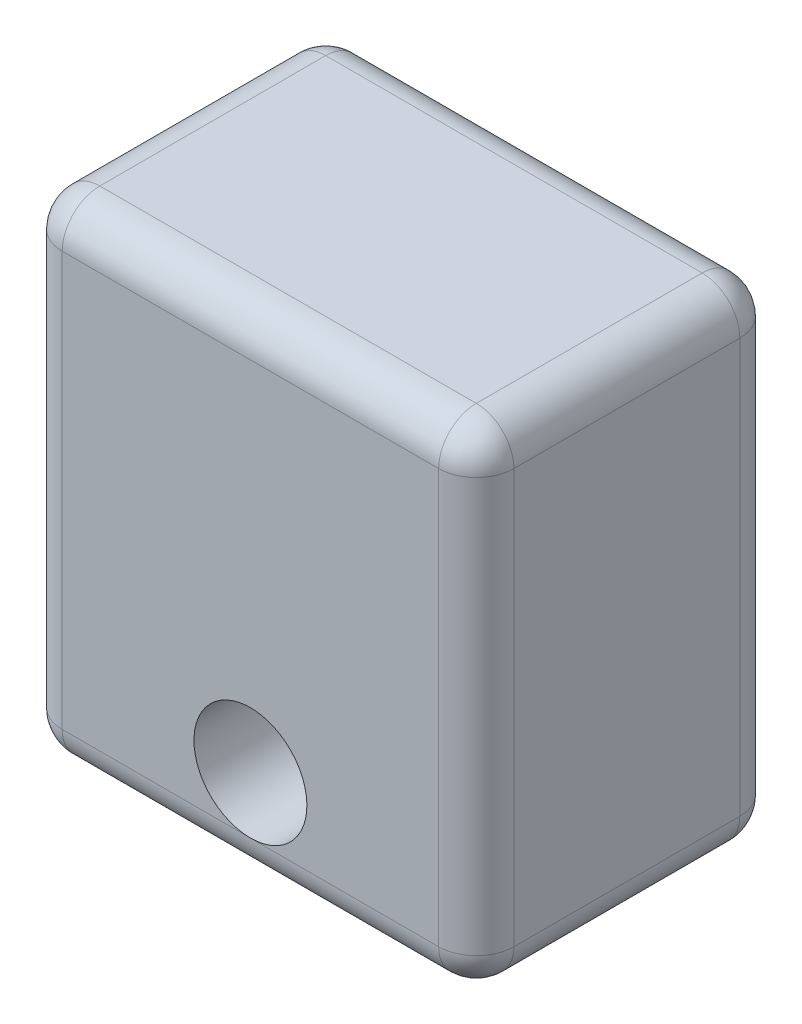
ISO-10303-21;
HEADER;
FILE_DESCRIPTION(('STEP AP214'),'2;1');
FILE_NAME('part.step','',(''),(''),'','','');
FILE_SCHEMA(('AUTOMOTIVE_DESIGN { 1 0 10303 214 1 1 1 1 }'));
ENDSEC;
DATA;
#1=APPLICATION_CONTEXT('core data for automotive mechanical design processes');
#2=APPLICATION_PROTOCOL_DEFINITION('international standard','automotive_design',2000,#1);
#3=PRODUCT_CONTEXT('',#1,'mechanical');
#4=PRODUCT('Part','Part','',(#3));
#5=PRODUCT_RELATED_PRODUCT_CATEGORY('part','',(#4));
#6=PRODUCT_DEFINITION_FORMATION('','',#4);
#7=PRODUCT_DEFINITION_CONTEXT('part definition',#1,'design');
#8=PRODUCT_DEFINITION('design','',#6,#7);
#9=PRODUCT_DEFINITION_SHAPE('','',#8);
#10=(LENGTH_UNIT() NAMED_UNIT(*) SI_UNIT(.MILLI.,.METRE.));
#11=(NAMED_UNIT(*) PLANE_ANGLE_UNIT() SI_UNIT($,.RADIAN.));
#12=(NAMED_UNIT(*) SI_UNIT($,.STERADIAN.) SOLID_ANGLE_UNIT());
#13=UNCERTAINTY_MEASURE_WITH_UNIT(LENGTH_MEASURE(1.E-05),#10,'distance_accuracy_value','');
#14=(GEOMETRIC_REPRESENTATION_CONTEXT(3) GLOBAL_UNCERTAINTY_ASSIGNED_CONTEXT((#13)) GLOBAL_UNIT_ASSIGNED_CONTEXT((#10,
#11,#12)) REPRESENTATION_CONTEXT('',''));
#15=CARTESIAN_POINT('',(0.,0.,0.));
#16=DIRECTION('',(0.,0.,1.));
#17=DIRECTION('',(1.,0.,0.));
#18=AXIS2_PLACEMENT_3D('',#15,#16,#17);
#19=CARTESIAN_POINT('',(0.,0.,25.4));
#20=DIRECTION('',(0.,0.,-1.));
#21=DIRECTION('',(-1.,0.,0.));
#22=AXIS2_PLACEMENT_3D('',#19,#20,#21);
#23=PLANE('',#22);
#24=DIRECTION('',(-1.,0.,0.));
#25=VECTOR('',#24,1.);
#26=CARTESIAN_POINT('',(0.,53.975,25.4));
#27=LINE('',#26,#25);
#28=CARTESIAN_POINT('',(31.75,53.975,25.4));
#29=VERTEX_POINT('',#28);
#30=CARTESIAN_POINT('',(-31.75,53.975,25.4));
#31=VERTEX_POINT('',#30);
#32=EDGE_CURVE('E204',#29,#31,#27,.T.);
#33=ORIENTED_EDGE('',*,*,#32,.T.);
#34=DIRECTION('',(0.,-1.,0.));
#35=VECTOR('',#34,1.);
#36=CARTESIAN_POINT('',(-31.75,0.,25.4));
#37=LINE('',#36,#35);
#38=CARTESIAN_POINT('',(-31.75,-15.875,25.4));
#39=VERTEX_POINT('',#38);
#40=EDGE_CURVE('E214',#31,#39,#37,.T.);
#41=ORIENTED_EDGE('',*,*,#40,.T.);
#42=DIRECTION('',(1.,0.,0.));
#43=VECTOR('',#42,1.);
#44=CARTESIAN_POINT('',(0.,-15.875,25.4));
#45=LINE('',#44,#43);
#46=CARTESIAN_POINT('',(0.,-15.875,25.4));
#47=VERTEX_POINT('',#46);
#48=EDGE_CURVE('E210',#39,#47,#45,.T.);
#49=ORIENTED_EDGE('',*,*,#48,.T.);
#50=CARTESIAN_POINT('',(0.,-6.35,25.4));
#51=DIRECTION('',(0.,0.,1.));
#52=DIRECTION('',(1.,0.,0.));
#53=AXIS2_PLACEMENT_3D('',#50,#51,#52);
#54=CIRCLE('',#53,9.525);
#55=EDGE_CURVE('E175',#47,#47,#54,.T.);
#56=ORIENTED_EDGE('',*,*,#55,.F.);
#57=DIRECTION('',(1.,0.,0.));
#58=VECTOR('',#57,1.);
#59=CARTESIAN_POINT('',(0.,-15.875,25.4));
#60=LINE('',#59,#58);
#61=CARTESIAN_POINT('',(31.75,-15.875,25.4));
#62=VERTEX_POINT('',#61);
#63=EDGE_CURVE('E207',#47,#62,#60,.T.);
#64=ORIENTED_EDGE('',*,*,#63,.T.);
#65=DIRECTION('',(0.,1.,0.));
#66=VECTOR('',#65,1.);
#67=CARTESIAN_POINT('',(31.75,0.,25.4));
#68=LINE('',#67,#66);
#69=EDGE_CURVE('E201',#62,#29,#68,.T.);
#70=ORIENTED_EDGE('',*,*,#69,.T.);
#71=EDGE_LOOP('',(#33,#41,#49,#56,#64,#70));
#72=FACE_BOUND('',#71,.T.);
#73=ADVANCED_FACE('F44',(#72),#23,.F.);
#74=CARTESIAN_POINT('',(0.,0.,-25.4));
#75=DIRECTION('',(0.,0.,-1.));
#76=DIRECTION('',(-1.,0.,0.));
#77=AXIS2_PLACEMENT_3D('',#74,#75,#76);
#78=PLANE('',#77);
#79=CARTESIAN_POINT('',(0.,-6.35,-25.4));
#80=DIRECTION('',(0.,0.,1.));
#81=DIRECTION('',(1.,0.,0.));
#82=AXIS2_PLACEMENT_3D('',#79,#80,#81);
#83=CIRCLE('',#82,9.525);
#84=CARTESIAN_POINT('',(0.,-15.875,-25.4));
#85=VERTEX_POINT('',#84);
#86=EDGE_CURVE('E346',#85,#85,#83,.T.);
#87=ORIENTED_EDGE('',*,*,#86,.T.);
#88=DIRECTION('',(1.,0.,0.));
#89=VECTOR('',#88,1.);
#90=CARTESIAN_POINT('',(-38.1,-15.875,-25.4));
#91=LINE('',#90,#89);
#92=CARTESIAN_POINT('',(-31.75,-15.875,-25.4));
#93=VERTEX_POINT('',#92);
#94=EDGE_CURVE('E243',#85,#93,#91,.F.);
#95=ORIENTED_EDGE('',*,*,#94,.T.);
#96=DIRECTION('',(0.,-1.,0.));
#97=VECTOR('',#96,1.);
#98=CARTESIAN_POINT('',(-31.75,60.325,-25.4));
#99=LINE('',#98,#97);
#100=CARTESIAN_POINT('',(-31.75,53.975,-25.4));
#101=VERTEX_POINT('',#100);
#102=EDGE_CURVE('E240',#93,#101,#99,.F.);
#103=ORIENTED_EDGE('',*,*,#102,.T.);
#104=DIRECTION('',(-1.,0.,0.));
#105=VECTOR('',#104,1.);
#106=CARTESIAN_POINT('',(38.1,53.975,-25.4));
#107=LINE('',#106,#105);
#108=CARTESIAN_POINT('',(31.75,53.975,-25.4));
#109=VERTEX_POINT('',#108);
#110=EDGE_CURVE('E233',#101,#109,#107,.F.);
#111=ORIENTED_EDGE('',*,*,#110,.T.);
#112=DIRECTION('',(0.,1.,0.));
#113=VECTOR('',#112,1.);
#114=CARTESIAN_POINT('',(31.75,-22.225,-25.4));
#115=LINE('',#114,#113);
#116=CARTESIAN_POINT('',(31.75,-15.875,-25.4));
#117=VERTEX_POINT('',#116);
#118=EDGE_CURVE('E230',#109,#117,#115,.F.);
#119=ORIENTED_EDGE('',*,*,#118,.T.);
#120=DIRECTION('',(1.,0.,0.));
#121=VECTOR('',#120,1.);
#122=CARTESIAN_POINT('',(-38.1,-15.875,-25.4));
#123=LINE('',#122,#121);
#124=EDGE_CURVE('E236',#117,#85,#123,.F.);
#125=ORIENTED_EDGE('',*,*,#124,.T.);
#126=EDGE_LOOP('',(#87,#95,#103,#111,#119,#125));
#127=FACE_BOUND('',#126,.T.);
#128=ADVANCED_FACE('F388',(#127),#78,.T.);
#129=CARTESIAN_POINT('',(38.1,-22.225,25.4));
#130=DIRECTION('',(-1.,0.,0.));
#131=DIRECTION('',(0.,-1.,0.));
#132=AXIS2_PLACEMENT_3D('',#129,#130,#131);
#133=PLANE('',#132);
#134=DIRECTION('',(0.,0.,-1.));
#135=VECTOR('',#134,1.);
#136=CARTESIAN_POINT('',(38.1,53.975,25.4));
#137=LINE('',#136,#135);
#138=CARTESIAN_POINT('',(38.1,53.975,-19.05));
#139=VERTEX_POINT('',#138);
#140=CARTESIAN_POINT('',(38.1,53.975,19.05));
#141=VERTEX_POINT('',#140);
#142=EDGE_CURVE('E220',#139,#141,#137,.F.);
#143=ORIENTED_EDGE('',*,*,#142,.T.);
#144=DIRECTION('',(0.,1.,0.));
#145=VECTOR('',#144,1.);
#146=CARTESIAN_POINT('',(38.1,-22.225,19.05));
#147=LINE('',#146,#145);
#148=CARTESIAN_POINT('',(38.1,-15.875,19.05));
#149=VERTEX_POINT('',#148);
#150=EDGE_CURVE('E227',#141,#149,#147,.F.);
#151=ORIENTED_EDGE('',*,*,#150,.T.);
#152=DIRECTION('',(0.,0.,-1.));
#153=VECTOR('',#152,1.);
#154=CARTESIAN_POINT('',(38.1,-15.875,25.4));
#155=LINE('',#154,#153);
#156=CARTESIAN_POINT('',(38.1,-15.875,-19.05));
#157=VERTEX_POINT('',#156);
#158=EDGE_CURVE('E223',#149,#157,#155,.T.);
#159=ORIENTED_EDGE('',*,*,#158,.T.);
#160=DIRECTION('',(0.,1.,0.));
#161=VECTOR('',#160,1.);
#162=CARTESIAN_POINT('',(38.1,60.325,-19.05));
#163=LINE('',#162,#161);
#164=EDGE_CURVE('E217',#157,#139,#163,.T.);
#165=ORIENTED_EDGE('',*,*,#164,.T.);
#166=EDGE_LOOP('',(#143,#151,#159,#165));
#167=FACE_BOUND('',#166,.T.);
#168=ADVANCED_FACE('F409',(#167),#133,.F.);
#169=CARTESIAN_POINT('',(-38.1,60.325,25.4));
#170=DIRECTION('',(0.,-1.,0.));
#171=DIRECTION('',(0.,0.,-1.));
#172=AXIS2_PLACEMENT_3D('',#169,#170,#171);
#173=PLANE('',#172);
#174=DIRECTION('',(-1.,0.,0.));
#175=VECTOR('',#174,1.);
#176=CARTESIAN_POINT('',(-38.1,60.325,19.05));
#177=LINE('',#176,#175);
#178=CARTESIAN_POINT('',(-31.75,60.325,19.05));
#179=VERTEX_POINT('',#178);
#180=CARTESIAN_POINT('',(31.75,60.325,19.05));
#181=VERTEX_POINT('',#180);
#182=EDGE_CURVE('E54',#179,#181,#177,.F.);
#183=ORIENTED_EDGE('',*,*,#182,.T.);
#184=DIRECTION('',(0.,0.,-1.));
#185=VECTOR('',#184,1.);
#186=CARTESIAN_POINT('',(31.75,60.325,25.4));
#187=LINE('',#186,#185);
#188=CARTESIAN_POINT('',(31.75,60.325,-19.05));
#189=VERTEX_POINT('',#188);
#190=EDGE_CURVE('E11',#181,#189,#187,.T.);
#191=ORIENTED_EDGE('',*,*,#190,.T.);
#192=DIRECTION('',(-1.,0.,0.));
#193=VECTOR('',#192,1.);
#194=CARTESIAN_POINT('',(-38.1,60.325,-19.05));
#195=LINE('',#194,#193);
#196=CARTESIAN_POINT('',(-31.75,60.325,-19.05));
#197=VERTEX_POINT('',#196);
#198=EDGE_CURVE('E246',#189,#197,#195,.T.);
#199=ORIENTED_EDGE('',*,*,#198,.T.);
#200=DIRECTION('',(0.,0.,-1.));
#201=VECTOR('',#200,1.);
#202=CARTESIAN_POINT('',(-31.75,60.325,25.4));
#203=LINE('',#202,#201);
#204=EDGE_CURVE('E65',#197,#179,#203,.F.);
#205=ORIENTED_EDGE('',*,*,#204,.T.);
#206=EDGE_LOOP('',(#183,#191,#199,#205));
#207=FACE_BOUND('',#206,.T.);
#208=ADVANCED_FACE('F413',(#207),#173,.F.);
#209=CARTESIAN_POINT('',(-38.1,-22.225,25.4));
#210=DIRECTION('',(1.,0.,0.));
#211=DIRECTION('',(0.,0.,-1.));
#212=AXIS2_PLACEMENT_3D('',#209,#210,#211);
#213=PLANE('',#212);
#214=CARTESIAN_POINT('',(-38.1,44.45,0.));
#215=DIRECTION('',(-1.,0.,0.));
#216=DIRECTION('',(0.,0.,1.));
#217=AXIS2_PLACEMENT_3D('',#214,#215,#216);
#218=CIRCLE('',#217,9.525);
#219=CARTESIAN_POINT('',(-38.1,53.975,0.));
#220=VERTEX_POINT('',#219);
#221=EDGE_CURVE('E333',#220,#220,#218,.T.);
#222=ORIENTED_EDGE('',*,*,#221,.F.);
#223=DIRECTION('',(0.,0.,-1.));
#224=VECTOR('',#223,1.);
#225=CARTESIAN_POINT('',(-38.1,53.975,25.4));
#226=LINE('',#225,#224);
#227=CARTESIAN_POINT('',(-38.1,53.975,-19.05));
#228=VERTEX_POINT('',#227);
#229=EDGE_CURVE('E198',#220,#228,#226,.T.);
#230=ORIENTED_EDGE('',*,*,#229,.T.);
#231=DIRECTION('',(0.,-1.,0.));
#232=VECTOR('',#231,1.);
#233=CARTESIAN_POINT('',(-38.1,-22.225,-19.05));
#234=LINE('',#233,#232);
#235=CARTESIAN_POINT('',(-38.1,-15.875,-19.05));
#236=VERTEX_POINT('',#235);
#237=EDGE_CURVE('E195',#228,#236,#234,.T.);
#238=ORIENTED_EDGE('',*,*,#237,.T.);
#239=DIRECTION('',(0.,0.,-1.));
#240=VECTOR('',#239,1.);
#241=CARTESIAN_POINT('',(-38.1,-15.875,25.4));
#242=LINE('',#241,#240);
#243=CARTESIAN_POINT('',(-38.1,-15.875,19.05));
#244=VERTEX_POINT('',#243);
#245=EDGE_CURVE('E149',#236,#244,#242,.F.);
#246=ORIENTED_EDGE('',*,*,#245,.T.);
#247=DIRECTION('',(0.,-1.,0.));
#248=VECTOR('',#247,1.);
#249=CARTESIAN_POINT('',(-38.1,-22.225,19.05));
#250=LINE('',#249,#248);
#251=CARTESIAN_POINT('',(-38.1,53.975,19.05));
#252=VERTEX_POINT('',#251);
#253=EDGE_CURVE('E182',#244,#252,#250,.F.);
#254=ORIENTED_EDGE('',*,*,#253,.T.);
#255=DIRECTION('',(0.,0.,-1.));
#256=VECTOR('',#255,1.);
#257=CARTESIAN_POINT('',(-38.1,53.975,25.4));
#258=LINE('',#257,#256);
#259=EDGE_CURVE('E186',#252,#220,#258,.T.);
#260=ORIENTED_EDGE('',*,*,#259,.T.);
#261=EDGE_LOOP('',(#222,#230,#238,#246,#254,#260));
#262=FACE_BOUND('',#261,.T.);
#263=ADVANCED_FACE('F378',(#262),#213,.F.);
#264=CARTESIAN_POINT('',(-38.1,-22.225,25.4));
#265=DIRECTION('',(0.,1.,0.));
#266=DIRECTION('',(0.,0.,1.));
#267=AXIS2_PLACEMENT_3D('',#264,#265,#266);
#268=PLANE('',#267);
#269=DIRECTION('',(1.,0.,0.));
#270=VECTOR('',#269,1.);
#271=CARTESIAN_POINT('',(-38.1,-22.225,19.05));
#272=LINE('',#271,#270);
#273=CARTESIAN_POINT('',(31.75,-22.225,19.05));
#274=VERTEX_POINT('',#273);
#275=CARTESIAN_POINT('',(-31.75,-22.225,19.05));
#276=VERTEX_POINT('',#275);
#277=EDGE_CURVE('E179',#274,#276,#272,.F.);
#278=ORIENTED_EDGE('',*,*,#277,.T.);
#279=DIRECTION('',(0.,0.,-1.));
#280=VECTOR('',#279,1.);
#281=CARTESIAN_POINT('',(-31.75,-22.225,25.4));
#282=LINE('',#281,#280);
#283=CARTESIAN_POINT('',(-31.75,-22.225,-19.05));
#284=VERTEX_POINT('',#283);
#285=EDGE_CURVE('E147',#276,#284,#282,.T.);
#286=ORIENTED_EDGE('',*,*,#285,.T.);
#287=DIRECTION('',(1.,0.,0.));
#288=VECTOR('',#287,1.);
#289=CARTESIAN_POINT('',(38.1,-22.225,-19.05));
#290=LINE('',#289,#288);
#291=CARTESIAN_POINT('',(31.75,-22.225,-19.05));
#292=VERTEX_POINT('',#291);
#293=EDGE_CURVE('E166',#284,#292,#290,.T.);
#294=ORIENTED_EDGE('',*,*,#293,.T.);
#295=DIRECTION('',(0.,0.,-1.));
#296=VECTOR('',#295,1.);
#297=CARTESIAN_POINT('',(31.75,-22.225,25.4));
#298=LINE('',#297,#296);
#299=EDGE_CURVE('E174',#292,#274,#298,.F.);
#300=ORIENTED_EDGE('',*,*,#299,.T.);
#301=EDGE_LOOP('',(#278,#286,#294,#300));
#302=FACE_BOUND('',#301,.T.);
#303=ADVANCED_FACE('F177',(#302),#268,.F.);
#304=CARTESIAN_POINT('',(0.,-6.35,25.4));
#305=DIRECTION('',(0.,0.,-1.));
#306=DIRECTION('',(-1.,0.,0.));
#307=AXIS2_PLACEMENT_3D('',#304,#305,#306);
#308=CYLINDRICAL_SURFACE('',#307,9.525);
#309=ORIENTED_EDGE('',*,*,#55,.T.);
#310=EDGE_LOOP('',(#309));
#311=FACE_BOUND('',#310,.T.);
#312=ORIENTED_EDGE('',*,*,#86,.F.);
#313=EDGE_LOOP('',(#312));
#314=FACE_BOUND('',#313,.T.);
#315=ADVANCED_FACE('F421',(#311,#314),#308,.F.);
#316=CARTESIAN_POINT('',(12.7,44.45,0.));
#317=DIRECTION('',(-1.,0.,0.));
#318=DIRECTION('',(0.,0.,1.));
#319=AXIS2_PLACEMENT_3D('',#316,#317,#318);
#320=CYLINDRICAL_SURFACE('',#319,9.525);
#321=CARTESIAN_POINT('',(12.7,44.45,0.));
#322=DIRECTION('',(-1.,0.,0.));
#323=DIRECTION('',(0.,0.,1.));
#324=AXIS2_PLACEMENT_3D('',#321,#322,#323);
#325=CIRCLE('',#324,9.525);
#326=CARTESIAN_POINT('',(12.7,44.45,9.525));
#327=VERTEX_POINT('',#326);
#328=EDGE_CURVE('E340',#327,#327,#325,.T.);
#329=ORIENTED_EDGE('',*,*,#328,.F.);
#330=EDGE_LOOP('',(#329));
#331=FACE_BOUND('',#330,.T.);
#332=ORIENTED_EDGE('',*,*,#221,.T.);
#333=EDGE_LOOP('',(#332));
#334=FACE_BOUND('',#333,.T.);
#335=ADVANCED_FACE('F423',(#331,#334),#320,.F.);
#336=CARTESIAN_POINT('',(12.7,44.45,0.));
#337=DIRECTION('',(-1.,0.,0.));
#338=DIRECTION('',(0.,0.,1.));
#339=AXIS2_PLACEMENT_3D('',#336,#337,#338);
#340=PLANE('',#339);
#341=ORIENTED_EDGE('',*,*,#328,.T.);
#342=EDGE_LOOP('',(#341));
#343=FACE_BOUND('',#342,.T.);
#344=ADVANCED_FACE('F430',(#343),#340,.T.);
#345=CARTESIAN_POINT('',(31.75,53.975,25.4));
#346=DIRECTION('',(0.,0.,-1.));
#347=DIRECTION('',(-1.,0.,0.));
#348=AXIS2_PLACEMENT_3D('',#345,#346,#347);
#349=CYLINDRICAL_SURFACE('',#348,6.35);
#350=CARTESIAN_POINT('',(31.75,53.975,19.05));
#351=DIRECTION('',(0.,0.,1.));
#352=DIRECTION('',(1.,0.,0.));
#353=AXIS2_PLACEMENT_3D('',#350,#351,#352);
#354=CIRCLE('',#353,6.35);
#355=EDGE_CURVE('E48',#141,#181,#354,.T.);
#356=ORIENTED_EDGE('',*,*,#355,.F.);
#357=ORIENTED_EDGE('',*,*,#142,.F.);
#358=CARTESIAN_POINT('',(31.75,53.975,-19.05));
#359=DIRECTION('',(0.,0.,-1.));
#360=DIRECTION('',(-1.,0.,0.));
#361=AXIS2_PLACEMENT_3D('',#358,#359,#360);
#362=CIRCLE('',#361,6.35);
#363=EDGE_CURVE('E324',#189,#139,#362,.T.);
#364=ORIENTED_EDGE('',*,*,#363,.F.);
#365=ORIENTED_EDGE('',*,*,#190,.F.);
#366=EDGE_LOOP('',(#356,#357,#364,#365));
#367=FACE_BOUND('',#366,.T.);
#368=ADVANCED_FACE('F46',(#367),#349,.T.);
#369=CARTESIAN_POINT('',(31.75,53.975,19.05));
#370=DIRECTION('',(0.,1.,0.));
#371=DIRECTION('',(-1.,0.,0.));
#372=AXIS2_PLACEMENT_3D('',#369,#370,#371);
#373=SPHERICAL_SURFACE('',#372,6.35);
#374=CARTESIAN_POINT('',(31.75,53.975,19.05));
#375=DIRECTION('',(0.,1.,0.));
#376=DIRECTION('',(0.,0.,1.));
#377=AXIS2_PLACEMENT_3D('',#374,#375,#376);
#378=CIRCLE('',#377,6.35);
#379=EDGE_CURVE('E317',#141,#29,#378,.F.);
#380=ORIENTED_EDGE('',*,*,#379,.F.);
#381=ORIENTED_EDGE('',*,*,#355,.T.);
#382=CARTESIAN_POINT('',(31.75,53.975,19.05));
#383=DIRECTION('',(1.,0.,0.));
#384=DIRECTION('',(0.,0.,-1.));
#385=AXIS2_PLACEMENT_3D('',#382,#383,#384);
#386=CIRCLE('',#385,6.35);
#387=EDGE_CURVE('E321',#29,#181,#386,.F.);
#388=ORIENTED_EDGE('',*,*,#387,.F.);
#389=EDGE_LOOP('',(#380,#381,#388));
#390=FACE_BOUND('',#389,.T.);
#391=ADVANCED_FACE('F403',(#390),#373,.T.);
#392=CARTESIAN_POINT('',(31.75,53.975,-19.05));
#393=DIRECTION('',(1.,0.,0.));
#394=DIRECTION('',(0.,0.,-1.));
#395=AXIS2_PLACEMENT_3D('',#392,#393,#394);
#396=SPHERICAL_SURFACE('',#395,6.35);
#397=CARTESIAN_POINT('',(31.75,53.975,-19.05));
#398=DIRECTION('',(1.,0.,0.));
#399=DIRECTION('',(0.,1.,0.));
#400=AXIS2_PLACEMENT_3D('',#397,#398,#399);
#401=CIRCLE('',#400,6.35);
#402=EDGE_CURVE('E309',#189,#109,#401,.F.);
#403=ORIENTED_EDGE('',*,*,#402,.F.);
#404=ORIENTED_EDGE('',*,*,#363,.T.);
#405=CARTESIAN_POINT('',(31.75,53.975,-19.05));
#406=DIRECTION('',(0.,1.,0.));
#407=DIRECTION('',(0.,0.,1.));
#408=AXIS2_PLACEMENT_3D('',#405,#406,#407);
#409=CIRCLE('',#408,6.35);
#410=EDGE_CURVE('E313',#109,#139,#409,.F.);
#411=ORIENTED_EDGE('',*,*,#410,.F.);
#412=EDGE_LOOP('',(#403,#404,#411));
#413=FACE_BOUND('',#412,.T.);
#414=ADVANCED_FACE('F414',(#413),#396,.T.);
#415=CARTESIAN_POINT('',(0.,53.975,19.05));
#416=DIRECTION('',(-1.,0.,0.));
#417=DIRECTION('',(0.,0.,1.));
#418=AXIS2_PLACEMENT_3D('',#415,#416,#417);
#419=CYLINDRICAL_SURFACE('',#418,6.35);
#420=ORIENTED_EDGE('',*,*,#387,.T.);
#421=ORIENTED_EDGE('',*,*,#182,.F.);
#422=CARTESIAN_POINT('',(-31.75,53.975,19.05));
#423=DIRECTION('',(-1.,0.,0.));
#424=DIRECTION('',(0.,0.,1.));
#425=AXIS2_PLACEMENT_3D('',#422,#423,#424);
#426=CIRCLE('',#425,6.35);
#427=EDGE_CURVE('E301',#31,#179,#426,.T.);
#428=ORIENTED_EDGE('',*,*,#427,.F.);
#429=ORIENTED_EDGE('',*,*,#32,.F.);
#430=EDGE_LOOP('',(#420,#421,#428,#429));
#431=FACE_BOUND('',#430,.T.);
#432=ADVANCED_FACE('F402',(#431),#419,.T.);
#433=CARTESIAN_POINT('',(31.75,0.,19.05));
#434=DIRECTION('',(0.,1.,0.));
#435=DIRECTION('',(-1.,0.,0.));
#436=AXIS2_PLACEMENT_3D('',#433,#434,#435);
#437=CYLINDRICAL_SURFACE('',#436,6.35);
#438=ORIENTED_EDGE('',*,*,#379,.T.);
#439=ORIENTED_EDGE('',*,*,#69,.F.);
#440=CARTESIAN_POINT('',(31.75,-15.875,19.05));
#441=DIRECTION('',(0.,-1.,0.));
#442=DIRECTION('',(0.,0.,-1.));
#443=AXIS2_PLACEMENT_3D('',#440,#441,#442);
#444=CIRCLE('',#443,6.35);
#445=EDGE_CURVE('E297',#149,#62,#444,.T.);
#446=ORIENTED_EDGE('',*,*,#445,.F.);
#447=ORIENTED_EDGE('',*,*,#150,.F.);
#448=EDGE_LOOP('',(#438,#439,#446,#447));
#449=FACE_BOUND('',#448,.T.);
#450=ADVANCED_FACE('F407',(#449),#437,.T.);
#451=CARTESIAN_POINT('',(31.75,-15.875,25.4));
#452=DIRECTION('',(0.,0.,-1.));
#453=DIRECTION('',(-1.,0.,0.));
#454=AXIS2_PLACEMENT_3D('',#451,#452,#453);
#455=CYLINDRICAL_SURFACE('',#454,6.35);
#456=CARTESIAN_POINT('',(31.75,-15.875,-19.05));
#457=DIRECTION('',(0.,0.,-1.));
#458=DIRECTION('',(-1.,0.,0.));
#459=AXIS2_PLACEMENT_3D('',#456,#457,#458);
#460=CIRCLE('',#459,6.35);
#461=EDGE_CURVE('E289',#157,#292,#460,.T.);
#462=ORIENTED_EDGE('',*,*,#461,.F.);
#463=ORIENTED_EDGE('',*,*,#158,.F.);
#464=CARTESIAN_POINT('',(31.75,-15.875,19.05));
#465=DIRECTION('',(0.,0.,1.));
#466=DIRECTION('',(1.,0.,0.));
#467=AXIS2_PLACEMENT_3D('',#464,#465,#466);
#468=CIRCLE('',#467,6.35);
#469=EDGE_CURVE('E293',#274,#149,#468,.T.);
#470=ORIENTED_EDGE('',*,*,#469,.F.);
#471=ORIENTED_EDGE('',*,*,#299,.F.);
#472=EDGE_LOOP('',(#462,#463,#470,#471));
#473=FACE_BOUND('',#472,.T.);
#474=ADVANCED_FACE('F360',(#473),#455,.T.);
#475=CARTESIAN_POINT('',(31.75,-22.225,-19.05));
#476=DIRECTION('',(0.,-1.,0.));
#477=DIRECTION('',(1.,0.,0.));
#478=AXIS2_PLACEMENT_3D('',#475,#476,#477);
#479=CYLINDRICAL_SURFACE('',#478,6.35);
#480=ORIENTED_EDGE('',*,*,#410,.T.);
#481=ORIENTED_EDGE('',*,*,#164,.F.);
#482=CARTESIAN_POINT('',(31.75,-15.875,-19.05));
#483=DIRECTION('',(0.,-1.,0.));
#484=DIRECTION('',(0.,0.,-1.));
#485=AXIS2_PLACEMENT_3D('',#482,#483,#484);
#486=CIRCLE('',#485,6.35);
#487=EDGE_CURVE('E286',#117,#157,#486,.T.);
#488=ORIENTED_EDGE('',*,*,#487,.F.);
#489=ORIENTED_EDGE('',*,*,#118,.F.);
#490=EDGE_LOOP('',(#480,#481,#488,#489));
#491=FACE_BOUND('',#490,.T.);
#492=ADVANCED_FACE('F418',(#491),#479,.T.);
#493=CARTESIAN_POINT('',(-38.1,53.975,-19.05));
#494=DIRECTION('',(1.,0.,0.));
#495=DIRECTION('',(0.,0.,-1.));
#496=AXIS2_PLACEMENT_3D('',#493,#494,#495);
#497=CYLINDRICAL_SURFACE('',#496,6.35);
#498=ORIENTED_EDGE('',*,*,#402,.T.);
#499=ORIENTED_EDGE('',*,*,#110,.F.);
#500=CARTESIAN_POINT('',(-31.75,53.975,-19.05));
#501=DIRECTION('',(-1.,0.,0.));
#502=DIRECTION('',(0.,0.,1.));
#503=AXIS2_PLACEMENT_3D('',#500,#501,#502);
#504=CIRCLE('',#503,6.35);
#505=EDGE_CURVE('E282',#197,#101,#504,.T.);
#506=ORIENTED_EDGE('',*,*,#505,.F.);
#507=ORIENTED_EDGE('',*,*,#198,.F.);
#508=EDGE_LOOP('',(#498,#499,#506,#507));
#509=FACE_BOUND('',#508,.T.);
#510=ADVANCED_FACE('F391',(#509),#497,.T.);
#511=CARTESIAN_POINT('',(-31.75,53.975,25.4));
#512=DIRECTION('',(0.,0.,-1.));
#513=DIRECTION('',(-1.,0.,0.));
#514=AXIS2_PLACEMENT_3D('',#511,#512,#513);
#515=CYLINDRICAL_SURFACE('',#514,6.35);
#516=CARTESIAN_POINT('',(-31.75,53.975,19.05));
#517=DIRECTION('',(0.,0.,1.));
#518=DIRECTION('',(1.,0.,0.));
#519=AXIS2_PLACEMENT_3D('',#516,#517,#518);
#520=CIRCLE('',#519,6.35);
#521=EDGE_CURVE('E305',#179,#252,#520,.T.);
#522=ORIENTED_EDGE('',*,*,#521,.F.);
#523=ORIENTED_EDGE('',*,*,#204,.F.);
#524=CARTESIAN_POINT('',(-31.75,53.975,-19.05));
#525=DIRECTION('',(0.,0.,-1.));
#526=DIRECTION('',(-1.,0.,0.));
#527=AXIS2_PLACEMENT_3D('',#524,#525,#526);
#528=CIRCLE('',#527,6.35);
#529=EDGE_CURVE('E278',#228,#197,#528,.T.);
#530=ORIENTED_EDGE('',*,*,#529,.F.);
#531=ORIENTED_EDGE('',*,*,#229,.F.);
#532=ORIENTED_EDGE('',*,*,#259,.F.);
#533=EDGE_LOOP('',(#522,#523,#530,#531,#532));
#534=FACE_BOUND('',#533,.T.);
#535=ADVANCED_FACE('F396',(#534),#515,.T.);
#536=CARTESIAN_POINT('',(-31.75,53.975,19.05));
#537=DIRECTION('',(0.,1.,0.));
#538=DIRECTION('',(0.,0.,1.));
#539=AXIS2_PLACEMENT_3D('',#536,#537,#538);
#540=SPHERICAL_SURFACE('',#539,6.35);
#541=ORIENTED_EDGE('',*,*,#427,.T.);
#542=ORIENTED_EDGE('',*,*,#521,.T.);
#543=CARTESIAN_POINT('',(-31.75,53.975,19.05));
#544=DIRECTION('',(0.,1.,0.));
#545=DIRECTION('',(0.,0.,1.));
#546=AXIS2_PLACEMENT_3D('',#543,#544,#545);
#547=CIRCLE('',#546,6.35);
#548=EDGE_CURVE('E274',#31,#252,#547,.F.);
#549=ORIENTED_EDGE('',*,*,#548,.F.);
#550=EDGE_LOOP('',(#541,#542,#549));
#551=FACE_BOUND('',#550,.T.);
#552=ADVANCED_FACE('F399',(#551),#540,.T.);
#553=CARTESIAN_POINT('',(31.75,-15.875,19.05));
#554=DIRECTION('',(1.,0.,0.));
#555=DIRECTION('',(0.,0.,-1.));
#556=AXIS2_PLACEMENT_3D('',#553,#554,#555);
#557=SPHERICAL_SURFACE('',#556,6.35);
#558=ORIENTED_EDGE('',*,*,#469,.T.);
#559=ORIENTED_EDGE('',*,*,#445,.T.);
#560=CARTESIAN_POINT('',(31.75,-15.875,19.05));
#561=DIRECTION('',(1.,0.,0.));
#562=DIRECTION('',(0.,0.,-1.));
#563=AXIS2_PLACEMENT_3D('',#560,#561,#562);
#564=CIRCLE('',#563,6.35);
#565=EDGE_CURVE('E270',#274,#62,#564,.F.);
#566=ORIENTED_EDGE('',*,*,#565,.F.);
#567=EDGE_LOOP('',(#558,#559,#566));
#568=FACE_BOUND('',#567,.T.);
#569=ADVANCED_FACE('F363',(#568),#557,.T.);
#570=CARTESIAN_POINT('',(31.75,-15.875,-19.05));
#571=DIRECTION('',(1.,0.,0.));
#572=DIRECTION('',(0.,0.,-1.));
#573=AXIS2_PLACEMENT_3D('',#570,#571,#572);
#574=SPHERICAL_SURFACE('',#573,6.35);
#575=ORIENTED_EDGE('',*,*,#487,.T.);
#576=ORIENTED_EDGE('',*,*,#461,.T.);
#577=CARTESIAN_POINT('',(31.75,-15.875,-19.05));
#578=DIRECTION('',(1.,0.,0.));
#579=DIRECTION('',(0.,0.,-1.));
#580=AXIS2_PLACEMENT_3D('',#577,#578,#579);
#581=CIRCLE('',#580,6.35);
#582=EDGE_CURVE('E170',#117,#292,#581,.F.);
#583=ORIENTED_EDGE('',*,*,#582,.F.);
#584=EDGE_LOOP('',(#575,#576,#583));
#585=FACE_BOUND('',#584,.T.);
#586=ADVANCED_FACE('F464',(#585),#574,.T.);
#587=CARTESIAN_POINT('',(-31.75,53.975,-19.05));
#588=DIRECTION('',(0.,1.,0.));
#589=DIRECTION('',(0.,0.,1.));
#590=AXIS2_PLACEMENT_3D('',#587,#588,#589);
#591=SPHERICAL_SURFACE('',#590,6.35);
#592=ORIENTED_EDGE('',*,*,#529,.T.);
#593=ORIENTED_EDGE('',*,*,#505,.T.);
#594=CARTESIAN_POINT('',(-31.75,53.975,-19.05));
#595=DIRECTION('',(0.,1.,0.));
#596=DIRECTION('',(-1.,0.,0.));
#597=AXIS2_PLACEMENT_3D('',#594,#595,#596);
#598=CIRCLE('',#597,6.35);
#599=EDGE_CURVE('E264',#228,#101,#598,.F.);
#600=ORIENTED_EDGE('',*,*,#599,.F.);
#601=EDGE_LOOP('',(#592,#593,#600));
#602=FACE_BOUND('',#601,.T.);
#603=ADVANCED_FACE('F393',(#602),#591,.T.);
#604=CARTESIAN_POINT('',(-31.75,0.,19.05));
#605=DIRECTION('',(0.,-1.,0.));
#606=DIRECTION('',(0.,0.,-1.));
#607=AXIS2_PLACEMENT_3D('',#604,#605,#606);
#608=CYLINDRICAL_SURFACE('',#607,6.35);
#609=ORIENTED_EDGE('',*,*,#548,.T.);
#610=ORIENTED_EDGE('',*,*,#253,.F.);
#611=CARTESIAN_POINT('',(-31.75,-15.875,19.05));
#612=DIRECTION('',(0.,-1.,0.));
#613=DIRECTION('',(0.,0.,-1.));
#614=AXIS2_PLACEMENT_3D('',#611,#612,#613);
#615=CIRCLE('',#614,6.35);
#616=EDGE_CURVE('E260',#39,#244,#615,.T.);
#617=ORIENTED_EDGE('',*,*,#616,.F.);
#618=ORIENTED_EDGE('',*,*,#40,.F.);
#619=EDGE_LOOP('',(#609,#610,#617,#618));
#620=FACE_BOUND('',#619,.T.);
#621=ADVANCED_FACE('F374',(#620),#608,.T.);
#622=CARTESIAN_POINT('',(0.,-15.875,19.05));
#623=DIRECTION('',(1.,0.,0.));
#624=DIRECTION('',(0.,0.,-1.));
#625=AXIS2_PLACEMENT_3D('',#622,#623,#624);
#626=CYLINDRICAL_SURFACE('',#625,6.35);
#627=ORIENTED_EDGE('',*,*,#63,.F.);
#628=ORIENTED_EDGE('',*,*,#48,.F.);
#629=CARTESIAN_POINT('',(-31.75,-15.875,19.05));
#630=DIRECTION('',(-1.,0.,0.));
#631=DIRECTION('',(0.,0.,1.));
#632=AXIS2_PLACEMENT_3D('',#629,#630,#631);
#633=CIRCLE('',#632,6.35);
#634=EDGE_CURVE('E163',#276,#39,#633,.T.);
#635=ORIENTED_EDGE('',*,*,#634,.F.);
#636=ORIENTED_EDGE('',*,*,#277,.F.);
#637=ORIENTED_EDGE('',*,*,#565,.T.);
#638=EDGE_LOOP('',(#627,#628,#635,#636,#637));
#639=FACE_BOUND('',#638,.T.);
#640=ADVANCED_FACE('F365',(#639),#626,.T.);
#641=CARTESIAN_POINT('',(-38.1,-15.875,-19.05));
#642=DIRECTION('',(-1.,0.,0.));
#643=DIRECTION('',(0.,0.,1.));
#644=AXIS2_PLACEMENT_3D('',#641,#642,#643);
#645=CYLINDRICAL_SURFACE('',#644,6.35);
#646=ORIENTED_EDGE('',*,*,#582,.T.);
#647=ORIENTED_EDGE('',*,*,#293,.F.);
#648=CARTESIAN_POINT('',(-31.75,-15.875,-19.05));
#649=DIRECTION('',(-1.,0.,0.));
#650=DIRECTION('',(0.,0.,1.));
#651=AXIS2_PLACEMENT_3D('',#648,#649,#650);
#652=CIRCLE('',#651,6.35);
#653=EDGE_CURVE('E156',#93,#284,#652,.T.);
#654=ORIENTED_EDGE('',*,*,#653,.F.);
#655=ORIENTED_EDGE('',*,*,#94,.F.);
#656=ORIENTED_EDGE('',*,*,#124,.F.);
#657=EDGE_LOOP('',(#646,#647,#654,#655,#656));
#658=FACE_BOUND('',#657,.T.);
#659=ADVANCED_FACE('F167',(#658),#645,.T.);
#660=CARTESIAN_POINT('',(-31.75,-22.225,-19.05));
#661=DIRECTION('',(0.,1.,0.));
#662=DIRECTION('',(0.,0.,1.));
#663=AXIS2_PLACEMENT_3D('',#660,#661,#662);
#664=CYLINDRICAL_SURFACE('',#663,6.35);
#665=ORIENTED_EDGE('',*,*,#599,.T.);
#666=ORIENTED_EDGE('',*,*,#102,.F.);
#667=CARTESIAN_POINT('',(-31.75,-15.875,-19.05));
#668=DIRECTION('',(0.,-1.,0.));
#669=DIRECTION('',(0.,0.,-1.));
#670=AXIS2_PLACEMENT_3D('',#667,#668,#669);
#671=CIRCLE('',#670,6.35);
#672=EDGE_CURVE('E160',#236,#93,#671,.T.);
#673=ORIENTED_EDGE('',*,*,#672,.F.);
#674=ORIENTED_EDGE('',*,*,#237,.F.);
#675=EDGE_LOOP('',(#665,#666,#673,#674));
#676=FACE_BOUND('',#675,.T.);
#677=ADVANCED_FACE('F384',(#676),#664,.T.);
#678=CARTESIAN_POINT('',(-31.75,-15.875,19.05));
#679=DIRECTION('',(0.,0.,1.));
#680=DIRECTION('',(1.,0.,0.));
#681=AXIS2_PLACEMENT_3D('',#678,#679,#680);
#682=SPHERICAL_SURFACE('',#681,6.35);
#683=ORIENTED_EDGE('',*,*,#634,.T.);
#684=ORIENTED_EDGE('',*,*,#616,.T.);
#685=CARTESIAN_POINT('',(-31.75,-15.875,19.05));
#686=DIRECTION('',(0.,0.,1.));
#687=DIRECTION('',(1.,0.,0.));
#688=AXIS2_PLACEMENT_3D('',#685,#686,#687);
#689=CIRCLE('',#688,6.35);
#690=EDGE_CURVE('E153',#276,#244,#689,.F.);
#691=ORIENTED_EDGE('',*,*,#690,.F.);
#692=EDGE_LOOP('',(#683,#684,#691));
#693=FACE_BOUND('',#692,.T.);
#694=ADVANCED_FACE('F370',(#693),#682,.T.);
#695=CARTESIAN_POINT('',(-31.75,-15.875,-19.05));
#696=DIRECTION('',(0.,0.,-1.));
#697=DIRECTION('',(-1.,0.,0.));
#698=AXIS2_PLACEMENT_3D('',#695,#696,#697);
#699=SPHERICAL_SURFACE('',#698,6.35);
#700=ORIENTED_EDGE('',*,*,#672,.T.);
#701=ORIENTED_EDGE('',*,*,#653,.T.);
#702=CARTESIAN_POINT('',(-31.75,-15.875,-19.05));
#703=DIRECTION('',(0.,0.,-1.));
#704=DIRECTION('',(-1.,0.,0.));
#705=AXIS2_PLACEMENT_3D('',#702,#703,#704);
#706=CIRCLE('',#705,6.35);
#707=EDGE_CURVE('E143',#236,#284,#706,.F.);
#708=ORIENTED_EDGE('',*,*,#707,.F.);
#709=EDGE_LOOP('',(#700,#701,#708));
#710=FACE_BOUND('',#709,.T.);
#711=ADVANCED_FACE('F158',(#710),#699,.T.);
#712=CARTESIAN_POINT('',(-31.75,-15.875,25.4));
#713=DIRECTION('',(0.,0.,-1.));
#714=DIRECTION('',(-1.,0.,0.));
#715=AXIS2_PLACEMENT_3D('',#712,#713,#714);
#716=CYLINDRICAL_SURFACE('',#715,6.35);
#717=ORIENTED_EDGE('',*,*,#690,.T.);
#718=ORIENTED_EDGE('',*,*,#245,.F.);
#719=ORIENTED_EDGE('',*,*,#707,.T.);
#720=ORIENTED_EDGE('',*,*,#285,.F.);
#721=EDGE_LOOP('',(#717,#718,#719,#720));
#722=FACE_BOUND('',#721,.T.);
#723=ADVANCED_FACE('F145',(#722),#716,.T.);
#724=CLOSED_SHELL('',(#73,#128,#168,#208,#263,#303,#315,#335,#344,#368,#391,#414,#432,#450,#474,
#492,#510,#535,#552,#569,#586,#603,#621,#640,#659,#677,#694,#711,#723));
#725=MANIFOLD_SOLID_BREP('B2',#724);
#726=ADVANCED_BREP_SHAPE_REPRESENTATION('',(#18,#725),#14);
#727=SHAPE_DEFINITION_REPRESENTATION(#9,#726);
ENDSEC;
END-ISO-10303-21;
